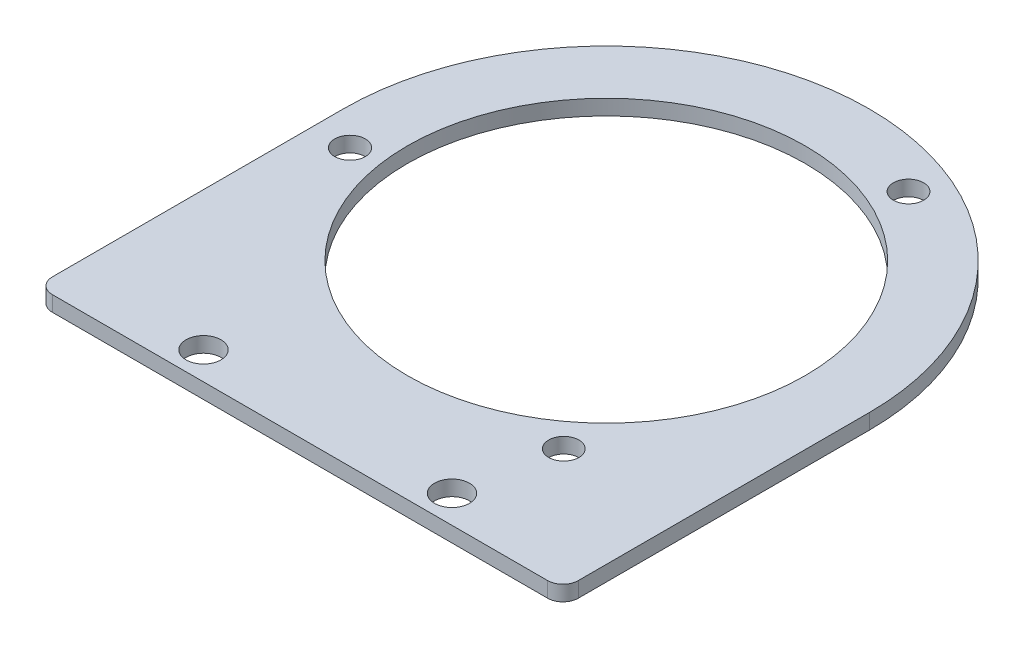
ISO-10303-21;
HEADER;
FILE_DESCRIPTION(('STEP AP214'),'2;1');
FILE_NAME('part.step','',(''),(''),'','','');
FILE_SCHEMA(('AUTOMOTIVE_DESIGN { 1 0 10303 214 1 1 1 1 }'));
ENDSEC;
DATA;
#1=APPLICATION_CONTEXT('core data for automotive mechanical design processes');
#2=APPLICATION_PROTOCOL_DEFINITION('international standard','automotive_design',2000,#1);
#3=PRODUCT_CONTEXT('',#1,'mechanical');
#4=PRODUCT('Part','Part','',(#3));
#5=PRODUCT_RELATED_PRODUCT_CATEGORY('part','',(#4));
#6=PRODUCT_DEFINITION_FORMATION('','',#4);
#7=PRODUCT_DEFINITION_CONTEXT('part definition',#1,'design');
#8=PRODUCT_DEFINITION('design','',#6,#7);
#9=PRODUCT_DEFINITION_SHAPE('','',#8);
#10=(LENGTH_UNIT() NAMED_UNIT(*) SI_UNIT(.MILLI.,.METRE.));
#11=(NAMED_UNIT(*) PLANE_ANGLE_UNIT() SI_UNIT($,.RADIAN.));
#12=(NAMED_UNIT(*) SI_UNIT($,.STERADIAN.) SOLID_ANGLE_UNIT());
#13=UNCERTAINTY_MEASURE_WITH_UNIT(LENGTH_MEASURE(1.E-05),#10,'distance_accuracy_value','');
#14=(GEOMETRIC_REPRESENTATION_CONTEXT(3) GLOBAL_UNCERTAINTY_ASSIGNED_CONTEXT((#13)) GLOBAL_UNIT_ASSIGNED_CONTEXT((#10,
#11,#12)) REPRESENTATION_CONTEXT('',''));
#15=CARTESIAN_POINT('',(0.,0.,0.));
#16=DIRECTION('',(0.,0.,1.));
#17=DIRECTION('',(1.,0.,0.));
#18=AXIS2_PLACEMENT_3D('',#15,#16,#17);
#19=CARTESIAN_POINT('',(-102.682677733851,6.35,120.65));
#20=DIRECTION('',(0.,-1.,0.));
#21=DIRECTION('',(0.,0.,-1.));
#22=AXIS2_PLACEMENT_3D('',#19,#20,#21);
#23=PLANE('',#22);
#24=CARTESIAN_POINT('',(51.5149387529781,6.35,115.487351308741));
#25=DIRECTION('',(0.,-1.,0.));
#26=DIRECTION('',(0.,0.,-1.));
#27=AXIS2_PLACEMENT_3D('',#24,#25,#26);
#28=CIRCLE('',#27,7.24664219784232);
#29=CARTESIAN_POINT('',(51.5149387529781,6.35,108.240709110899));
#30=VERTEX_POINT('',#29);
#31=EDGE_CURVE('E287',#30,#30,#28,.T.);
#32=ORIENTED_EDGE('',*,*,#31,.T.);
#33=EDGE_LOOP('',(#32));
#34=FACE_BOUND('',#33,.T.);
#35=CARTESIAN_POINT('',(-102.682677733851,6.35,120.65));
#36=DIRECTION('',(0.,-1.,0.));
#37=DIRECTION('',(0.,0.,-1.));
#38=AXIS2_PLACEMENT_3D('',#35,#36,#37);
#39=CIRCLE('',#38,6.34999999999998);
#40=CARTESIAN_POINT('',(-102.682677733851,6.35,127.));
#41=VERTEX_POINT('',#40);
#42=CARTESIAN_POINT('',(-109.032677733851,6.35,120.65));
#43=VERTEX_POINT('',#42);
#44=EDGE_CURVE('E269',#41,#43,#39,.T.);
#45=ORIENTED_EDGE('',*,*,#44,.F.);
#46=DIRECTION('',(1.,0.,0.));
#47=VECTOR('',#46,1.);
#48=CARTESIAN_POINT('',(-102.682677733851,6.35,127.));
#49=LINE('',#48,#47);
#50=CARTESIAN_POINT('',(102.682677733851,6.35,127.));
#51=VERTEX_POINT('',#50);
#52=EDGE_CURVE('E235',#41,#51,#49,.T.);
#53=ORIENTED_EDGE('',*,*,#52,.T.);
#54=CARTESIAN_POINT('',(102.682677733851,6.35,120.65));
#55=DIRECTION('',(0.,1.,0.));
#56=DIRECTION('',(0.,0.,1.));
#57=AXIS2_PLACEMENT_3D('',#54,#55,#56);
#58=CIRCLE('',#57,6.35000000000001);
#59=CARTESIAN_POINT('',(109.032677733851,6.35,120.65));
#60=VERTEX_POINT('',#59);
#61=EDGE_CURVE('E229',#51,#60,#58,.T.);
#62=ORIENTED_EDGE('',*,*,#61,.T.);
#63=DIRECTION('',(0.,0.,-1.));
#64=VECTOR('',#63,1.);
#65=CARTESIAN_POINT('',(109.032677733851,6.35,120.65));
#66=LINE('',#65,#64);
#67=CARTESIAN_POINT('',(109.032677733851,6.35,0.));
#68=VERTEX_POINT('',#67);
#69=EDGE_CURVE('E233',#60,#68,#66,.T.);
#70=ORIENTED_EDGE('',*,*,#69,.T.);
#71=CARTESIAN_POINT('',(0.,6.35,0.));
#72=DIRECTION('',(0.,-1.,0.));
#73=DIRECTION('',(0.,0.,-1.));
#74=AXIS2_PLACEMENT_3D('',#71,#72,#73);
#75=CIRCLE('',#74,109.032677733851);
#76=CARTESIAN_POINT('',(-109.032677733851,6.35,0.));
#77=VERTEX_POINT('',#76);
#78=EDGE_CURVE('E250',#77,#68,#75,.T.);
#79=ORIENTED_EDGE('',*,*,#78,.F.);
#80=DIRECTION('',(0.,0.,1.));
#81=VECTOR('',#80,1.);
#82=CARTESIAN_POINT('',(-109.032677733851,6.35,0.));
#83=LINE('',#82,#81);
#84=EDGE_CURVE('E220',#77,#43,#83,.T.);
#85=ORIENTED_EDGE('',*,*,#84,.T.);
#86=EDGE_LOOP('',(#45,#53,#62,#70,#79,#85));
#87=FACE_BOUND('',#86,.T.);
#88=CARTESIAN_POINT('',(0.,6.35,0.));
#89=DIRECTION('',(0.,1.,0.));
#90=DIRECTION('',(0.,0.,1.));
#91=AXIS2_PLACEMENT_3D('',#88,#89,#90);
#92=CIRCLE('',#91,82.4943104699617);
#93=CARTESIAN_POINT('',(0.,6.35,82.4943104699617));
#94=VERTEX_POINT('',#93);
#95=EDGE_CURVE('E260',#94,#94,#92,.T.);
#96=ORIENTED_EDGE('',*,*,#95,.F.);
#97=EDGE_LOOP('',(#96));
#98=FACE_BOUND('',#97,.T.);
#99=CARTESIAN_POINT('',(-51.5149387529781,6.35,115.487351308741));
#100=DIRECTION('',(0.,1.,0.));
#101=DIRECTION('',(0.,0.,1.));
#102=AXIS2_PLACEMENT_3D('',#99,#100,#101);
#103=CIRCLE('',#102,7.24664219784231);
#104=CARTESIAN_POINT('',(-51.5149387529781,6.35,122.733993506584));
#105=VERTEX_POINT('',#104);
#106=EDGE_CURVE('E293',#105,#105,#103,.T.);
#107=ORIENTED_EDGE('',*,*,#106,.F.);
#108=EDGE_LOOP('',(#107));
#109=FACE_BOUND('',#108,.T.);
#110=CARTESIAN_POINT('',(-93.6824363090608,6.35,12.5610675607337));
#111=DIRECTION('',(0.,1.,0.));
#112=DIRECTION('',(0.,0.,1.));
#113=AXIS2_PLACEMENT_3D('',#110,#111,#112);
#114=CIRCLE('',#113,6.35187519048072);
#115=CARTESIAN_POINT('',(-93.6824363090608,6.35,18.9129427512144));
#116=VERTEX_POINT('',#115);
#117=EDGE_CURVE('E299',#116,#116,#114,.T.);
#118=ORIENTED_EDGE('',*,*,#117,.F.);
#119=EDGE_LOOP('',(#118));
#120=FACE_BOUND('',#119,.T.);
#121=CARTESIAN_POINT('',(58.6973577692165,6.35,76.3198753039074));
#122=DIRECTION('',(0.,1.,0.));
#123=DIRECTION('',(0.,0.,1.));
#124=AXIS2_PLACEMENT_3D('',#121,#122,#123);
#125=CIRCLE('',#124,6.27839869121901);
#126=CARTESIAN_POINT('',(58.6973577692165,6.35,82.5982739951264));
#127=VERTEX_POINT('',#126);
#128=EDGE_CURVE('E305',#127,#127,#125,.T.);
#129=ORIENTED_EDGE('',*,*,#128,.F.);
#130=EDGE_LOOP('',(#129));
#131=FACE_BOUND('',#130,.T.);
#132=CARTESIAN_POINT('',(37.8028439954295,6.35,-87.5004935949573));
#133=DIRECTION('',(0.,1.,0.));
#134=DIRECTION('',(0.,0.,1.));
#135=AXIS2_PLACEMENT_3D('',#132,#133,#134);
#136=CIRCLE('',#135,6.28350227414745);
#137=CARTESIAN_POINT('',(37.8028439954295,6.35,-81.2169913208098));
#138=VERTEX_POINT('',#137);
#139=EDGE_CURVE('E311',#138,#138,#136,.T.);
#140=ORIENTED_EDGE('',*,*,#139,.F.);
#141=EDGE_LOOP('',(#140));
#142=FACE_BOUND('',#141,.T.);
#143=ADVANCED_FACE('F170',(#34,#87,#98,#109,#120,#131,#142),#23,.F.);
#144=CARTESIAN_POINT('',(-102.682677733851,0.,120.65));
#145=DIRECTION('',(0.,-1.,0.));
#146=DIRECTION('',(0.,0.,-1.));
#147=AXIS2_PLACEMENT_3D('',#144,#145,#146);
#148=PLANE('',#147);
#149=CARTESIAN_POINT('',(58.6973577692165,0.,76.3198753039074));
#150=DIRECTION('',(0.,1.,0.));
#151=DIRECTION('',(0.,0.,1.));
#152=AXIS2_PLACEMENT_3D('',#149,#150,#151);
#153=CIRCLE('',#152,6.27839869121901);
#154=CARTESIAN_POINT('',(58.6973577692165,0.,82.5982739951264));
#155=VERTEX_POINT('',#154);
#156=EDGE_CURVE('E308',#155,#155,#153,.T.);
#157=ORIENTED_EDGE('',*,*,#156,.T.);
#158=EDGE_LOOP('',(#157));
#159=FACE_BOUND('',#158,.T.);
#160=CARTESIAN_POINT('',(-51.5149387529781,0.,115.487351308741));
#161=DIRECTION('',(0.,1.,0.));
#162=DIRECTION('',(0.,0.,1.));
#163=AXIS2_PLACEMENT_3D('',#160,#161,#162);
#164=CIRCLE('',#163,7.24664219784231);
#165=CARTESIAN_POINT('',(-51.5149387529781,0.,122.733993506584));
#166=VERTEX_POINT('',#165);
#167=EDGE_CURVE('E296',#166,#166,#164,.T.);
#168=ORIENTED_EDGE('',*,*,#167,.T.);
#169=EDGE_LOOP('',(#168));
#170=FACE_BOUND('',#169,.T.);
#171=CARTESIAN_POINT('',(51.5149387529781,0.,115.487351308741));
#172=DIRECTION('',(0.,-1.,0.));
#173=DIRECTION('',(0.,0.,-1.));
#174=AXIS2_PLACEMENT_3D('',#171,#172,#173);
#175=CIRCLE('',#174,7.24664219784232);
#176=CARTESIAN_POINT('',(51.5149387529781,0.,108.240709110899));
#177=VERTEX_POINT('',#176);
#178=EDGE_CURVE('E290',#177,#177,#175,.T.);
#179=ORIENTED_EDGE('',*,*,#178,.F.);
#180=EDGE_LOOP('',(#179));
#181=FACE_BOUND('',#180,.T.);
#182=CARTESIAN_POINT('',(-102.682677733851,0.,120.65));
#183=DIRECTION('',(0.,-1.,0.));
#184=DIRECTION('',(0.,0.,-1.));
#185=AXIS2_PLACEMENT_3D('',#182,#183,#184);
#186=CIRCLE('',#185,6.34999999999998);
#187=CARTESIAN_POINT('',(-102.682677733851,0.,127.));
#188=VERTEX_POINT('',#187);
#189=CARTESIAN_POINT('',(-109.032677733851,0.,120.65));
#190=VERTEX_POINT('',#189);
#191=EDGE_CURVE('E256',#188,#190,#186,.T.);
#192=ORIENTED_EDGE('',*,*,#191,.T.);
#193=DIRECTION('',(0.,0.,1.));
#194=VECTOR('',#193,1.);
#195=CARTESIAN_POINT('',(-109.032677733851,0.,0.));
#196=LINE('',#195,#194);
#197=CARTESIAN_POINT('',(-109.032677733851,0.,0.));
#198=VERTEX_POINT('',#197);
#199=EDGE_CURVE('E259',#198,#190,#196,.T.);
#200=ORIENTED_EDGE('',*,*,#199,.F.);
#201=CARTESIAN_POINT('',(0.,0.,0.));
#202=DIRECTION('',(0.,-1.,0.));
#203=DIRECTION('',(0.,0.,-1.));
#204=AXIS2_PLACEMENT_3D('',#201,#202,#203);
#205=CIRCLE('',#204,109.032677733851);
#206=CARTESIAN_POINT('',(109.032677733851,0.,0.));
#207=VERTEX_POINT('',#206);
#208=EDGE_CURVE('E263',#198,#207,#205,.T.);
#209=ORIENTED_EDGE('',*,*,#208,.T.);
#210=DIRECTION('',(0.,0.,-1.));
#211=VECTOR('',#210,1.);
#212=CARTESIAN_POINT('',(109.032677733851,0.,120.65));
#213=LINE('',#212,#211);
#214=CARTESIAN_POINT('',(109.032677733851,0.,120.65));
#215=VERTEX_POINT('',#214);
#216=EDGE_CURVE('E266',#215,#207,#213,.T.);
#217=ORIENTED_EDGE('',*,*,#216,.F.);
#218=CARTESIAN_POINT('',(102.682677733851,0.,120.65));
#219=DIRECTION('',(0.,1.,0.));
#220=DIRECTION('',(0.,0.,1.));
#221=AXIS2_PLACEMENT_3D('',#218,#219,#220);
#222=CIRCLE('',#221,6.35000000000001);
#223=CARTESIAN_POINT('',(102.682677733851,0.,127.));
#224=VERTEX_POINT('',#223);
#225=EDGE_CURVE('E242',#224,#215,#222,.T.);
#226=ORIENTED_EDGE('',*,*,#225,.F.);
#227=DIRECTION('',(1.,0.,0.));
#228=VECTOR('',#227,1.);
#229=CARTESIAN_POINT('',(-102.682677733851,0.,127.));
#230=LINE('',#229,#228);
#231=EDGE_CURVE('E210',#188,#224,#230,.T.);
#232=ORIENTED_EDGE('',*,*,#231,.F.);
#233=EDGE_LOOP('',(#192,#200,#209,#217,#226,#232));
#234=FACE_BOUND('',#233,.T.);
#235=CARTESIAN_POINT('',(0.,0.,0.));
#236=DIRECTION('',(0.,1.,0.));
#237=DIRECTION('',(0.,0.,1.));
#238=AXIS2_PLACEMENT_3D('',#235,#236,#237);
#239=CIRCLE('',#238,82.4943104699617);
#240=CARTESIAN_POINT('',(0.,0.,82.4943104699617));
#241=VERTEX_POINT('',#240);
#242=EDGE_CURVE('E284',#241,#241,#239,.T.);
#243=ORIENTED_EDGE('',*,*,#242,.T.);
#244=EDGE_LOOP('',(#243));
#245=FACE_BOUND('',#244,.T.);
#246=CARTESIAN_POINT('',(-93.6824363090608,0.,12.5610675607337));
#247=DIRECTION('',(0.,1.,0.));
#248=DIRECTION('',(0.,0.,1.));
#249=AXIS2_PLACEMENT_3D('',#246,#247,#248);
#250=CIRCLE('',#249,6.35187519048072);
#251=CARTESIAN_POINT('',(-93.6824363090608,0.,18.9129427512144));
#252=VERTEX_POINT('',#251);
#253=EDGE_CURVE('E302',#252,#252,#250,.T.);
#254=ORIENTED_EDGE('',*,*,#253,.T.);
#255=EDGE_LOOP('',(#254));
#256=FACE_BOUND('',#255,.T.);
#257=CARTESIAN_POINT('',(37.8028439954295,0.,-87.5004935949573));
#258=DIRECTION('',(0.,1.,0.));
#259=DIRECTION('',(0.,0.,1.));
#260=AXIS2_PLACEMENT_3D('',#257,#258,#259);
#261=CIRCLE('',#260,6.28350227414745);
#262=CARTESIAN_POINT('',(37.8028439954295,0.,-81.2169913208098));
#263=VERTEX_POINT('',#262);
#264=EDGE_CURVE('E314',#263,#263,#261,.T.);
#265=ORIENTED_EDGE('',*,*,#264,.T.);
#266=EDGE_LOOP('',(#265));
#267=FACE_BOUND('',#266,.T.);
#268=ADVANCED_FACE('F278',(#159,#170,#181,#234,#245,#256,#267),#148,.T.);
#269=CARTESIAN_POINT('',(-102.682677733851,6.35,120.65));
#270=DIRECTION('',(0.,-1.,0.));
#271=DIRECTION('',(0.,0.,-1.));
#272=AXIS2_PLACEMENT_3D('',#269,#270,#271);
#273=CYLINDRICAL_SURFACE('',#272,6.34999999999998);
#274=ORIENTED_EDGE('',*,*,#191,.F.);
#275=DIRECTION('',(0.,-1.,0.));
#276=VECTOR('',#275,1.);
#277=CARTESIAN_POINT('',(-102.682677733851,6.35,127.));
#278=LINE('',#277,#276);
#279=EDGE_CURVE('E12',#41,#188,#278,.T.);
#280=ORIENTED_EDGE('',*,*,#279,.F.);
#281=ORIENTED_EDGE('',*,*,#44,.T.);
#282=DIRECTION('',(0.,-1.,0.));
#283=VECTOR('',#282,1.);
#284=CARTESIAN_POINT('',(-109.032677733851,6.35,120.65));
#285=LINE('',#284,#283);
#286=EDGE_CURVE('E174',#43,#190,#285,.T.);
#287=ORIENTED_EDGE('',*,*,#286,.T.);
#288=EDGE_LOOP('',(#274,#280,#281,#287));
#289=FACE_BOUND('',#288,.T.);
#290=ADVANCED_FACE('F172',(#289),#273,.T.);
#291=CARTESIAN_POINT('',(-102.682677733851,6.35,127.));
#292=DIRECTION('',(0.,0.,-1.));
#293=DIRECTION('',(-1.,0.,0.));
#294=AXIS2_PLACEMENT_3D('',#291,#292,#293);
#295=PLANE('',#294);
#296=ORIENTED_EDGE('',*,*,#231,.T.);
#297=DIRECTION('',(0.,-1.,0.));
#298=VECTOR('',#297,1.);
#299=CARTESIAN_POINT('',(102.682677733851,6.35,127.));
#300=LINE('',#299,#298);
#301=EDGE_CURVE('E180',#51,#224,#300,.T.);
#302=ORIENTED_EDGE('',*,*,#301,.F.);
#303=ORIENTED_EDGE('',*,*,#52,.F.);
#304=ORIENTED_EDGE('',*,*,#279,.T.);
#305=EDGE_LOOP('',(#296,#302,#303,#304));
#306=FACE_BOUND('',#305,.T.);
#307=ADVANCED_FACE('F335',(#306),#295,.F.);
#308=CARTESIAN_POINT('',(102.682677733851,6.35,120.65));
#309=DIRECTION('',(0.,-1.,0.));
#310=DIRECTION('',(0.,0.,-1.));
#311=AXIS2_PLACEMENT_3D('',#308,#309,#310);
#312=CYLINDRICAL_SURFACE('',#311,6.35000000000001);
#313=ORIENTED_EDGE('',*,*,#225,.T.);
#314=DIRECTION('',(0.,-1.,0.));
#315=VECTOR('',#314,1.);
#316=CARTESIAN_POINT('',(109.032677733851,6.35,120.65));
#317=LINE('',#316,#315);
#318=EDGE_CURVE('E239',#60,#215,#317,.T.);
#319=ORIENTED_EDGE('',*,*,#318,.F.);
#320=ORIENTED_EDGE('',*,*,#61,.F.);
#321=ORIENTED_EDGE('',*,*,#301,.T.);
#322=EDGE_LOOP('',(#313,#319,#320,#321));
#323=FACE_BOUND('',#322,.T.);
#324=ADVANCED_FACE('F240',(#323),#312,.T.);
#325=CARTESIAN_POINT('',(109.032677733851,6.35,120.65));
#326=DIRECTION('',(-1.,0.,0.));
#327=DIRECTION('',(0.,0.,1.));
#328=AXIS2_PLACEMENT_3D('',#325,#326,#327);
#329=PLANE('',#328);
#330=ORIENTED_EDGE('',*,*,#216,.T.);
#331=DIRECTION('',(0.,-1.,0.));
#332=VECTOR('',#331,1.);
#333=CARTESIAN_POINT('',(109.032677733851,6.35,0.));
#334=LINE('',#333,#332);
#335=EDGE_CURVE('E246',#68,#207,#334,.T.);
#336=ORIENTED_EDGE('',*,*,#335,.F.);
#337=ORIENTED_EDGE('',*,*,#69,.F.);
#338=ORIENTED_EDGE('',*,*,#318,.T.);
#339=EDGE_LOOP('',(#330,#336,#337,#338));
#340=FACE_BOUND('',#339,.T.);
#341=ADVANCED_FACE('F248',(#340),#329,.F.);
#342=CARTESIAN_POINT('',(0.,6.35,0.));
#343=DIRECTION('',(0.,-1.,0.));
#344=DIRECTION('',(0.,0.,-1.));
#345=AXIS2_PLACEMENT_3D('',#342,#343,#344);
#346=CYLINDRICAL_SURFACE('',#345,109.032677733851);
#347=ORIENTED_EDGE('',*,*,#208,.F.);
#348=DIRECTION('',(0.,-1.,0.));
#349=VECTOR('',#348,1.);
#350=CARTESIAN_POINT('',(-109.032677733851,6.35,0.));
#351=LINE('',#350,#349);
#352=EDGE_CURVE('E272',#77,#198,#351,.T.);
#353=ORIENTED_EDGE('',*,*,#352,.F.);
#354=ORIENTED_EDGE('',*,*,#78,.T.);
#355=ORIENTED_EDGE('',*,*,#335,.T.);
#356=EDGE_LOOP('',(#347,#353,#354,#355));
#357=FACE_BOUND('',#356,.T.);
#358=ADVANCED_FACE('F281',(#357),#346,.T.);
#359=CARTESIAN_POINT('',(-109.032677733851,6.35,0.));
#360=DIRECTION('',(1.,0.,0.));
#361=DIRECTION('',(0.,0.,-1.));
#362=AXIS2_PLACEMENT_3D('',#359,#360,#361);
#363=PLANE('',#362);
#364=ORIENTED_EDGE('',*,*,#199,.T.);
#365=ORIENTED_EDGE('',*,*,#286,.F.);
#366=ORIENTED_EDGE('',*,*,#84,.F.);
#367=ORIENTED_EDGE('',*,*,#352,.T.);
#368=EDGE_LOOP('',(#364,#365,#366,#367));
#369=FACE_BOUND('',#368,.T.);
#370=ADVANCED_FACE('F275',(#369),#363,.F.);
#371=CARTESIAN_POINT('',(0.,6.35,0.));
#372=DIRECTION('',(0.,-1.,0.));
#373=DIRECTION('',(0.,0.,-1.));
#374=AXIS2_PLACEMENT_3D('',#371,#372,#373);
#375=CYLINDRICAL_SURFACE('',#374,82.4943104699617);
#376=ORIENTED_EDGE('',*,*,#95,.T.);
#377=EDGE_LOOP('',(#376));
#378=FACE_BOUND('',#377,.T.);
#379=ORIENTED_EDGE('',*,*,#242,.F.);
#380=EDGE_LOOP('',(#379));
#381=FACE_BOUND('',#380,.T.);
#382=ADVANCED_FACE('F332',(#378,#381),#375,.F.);
#383=CARTESIAN_POINT('',(51.5149387529781,6.35,115.487351308741));
#384=DIRECTION('',(0.,-1.,0.));
#385=DIRECTION('',(0.,0.,-1.));
#386=AXIS2_PLACEMENT_3D('',#383,#384,#385);
#387=CYLINDRICAL_SURFACE('',#386,7.24664219784232);
#388=ORIENTED_EDGE('',*,*,#31,.F.);
#389=EDGE_LOOP('',(#388));
#390=FACE_BOUND('',#389,.T.);
#391=ORIENTED_EDGE('',*,*,#178,.T.);
#392=EDGE_LOOP('',(#391));
#393=FACE_BOUND('',#392,.T.);
#394=ADVANCED_FACE('F347',(#390,#393),#387,.F.);
#395=CARTESIAN_POINT('',(-51.5149387529781,6.35,115.487351308741));
#396=DIRECTION('',(0.,-1.,0.));
#397=DIRECTION('',(0.,0.,-1.));
#398=AXIS2_PLACEMENT_3D('',#395,#396,#397);
#399=CYLINDRICAL_SURFACE('',#398,7.24664219784231);
#400=ORIENTED_EDGE('',*,*,#106,.T.);
#401=EDGE_LOOP('',(#400));
#402=FACE_BOUND('',#401,.T.);
#403=ORIENTED_EDGE('',*,*,#167,.F.);
#404=EDGE_LOOP('',(#403));
#405=FACE_BOUND('',#404,.T.);
#406=ADVANCED_FACE('F352',(#402,#405),#399,.F.);
#407=CARTESIAN_POINT('',(-93.6824363090608,6.35,12.5610675607337));
#408=DIRECTION('',(0.,-1.,0.));
#409=DIRECTION('',(0.,0.,-1.));
#410=AXIS2_PLACEMENT_3D('',#407,#408,#409);
#411=CYLINDRICAL_SURFACE('',#410,6.35187519048072);
#412=ORIENTED_EDGE('',*,*,#117,.T.);
#413=EDGE_LOOP('',(#412));
#414=FACE_BOUND('',#413,.T.);
#415=ORIENTED_EDGE('',*,*,#253,.F.);
#416=EDGE_LOOP('',(#415));
#417=FACE_BOUND('',#416,.T.);
#418=ADVANCED_FACE('F367',(#414,#417),#411,.F.);
#419=CARTESIAN_POINT('',(58.6973577692165,6.35,76.3198753039074));
#420=DIRECTION('',(0.,-1.,0.));
#421=DIRECTION('',(0.,0.,-1.));
#422=AXIS2_PLACEMENT_3D('',#419,#420,#421);
#423=CYLINDRICAL_SURFACE('',#422,6.27839869121901);
#424=ORIENTED_EDGE('',*,*,#128,.T.);
#425=EDGE_LOOP('',(#424));
#426=FACE_BOUND('',#425,.T.);
#427=ORIENTED_EDGE('',*,*,#156,.F.);
#428=EDGE_LOOP('',(#427));
#429=FACE_BOUND('',#428,.T.);
#430=ADVANCED_FACE('F362',(#426,#429),#423,.F.);
#431=CARTESIAN_POINT('',(37.8028439954295,6.35,-87.5004935949573));
#432=DIRECTION('',(0.,-1.,0.));
#433=DIRECTION('',(0.,0.,-1.));
#434=AXIS2_PLACEMENT_3D('',#431,#432,#433);
#435=CYLINDRICAL_SURFACE('',#434,6.28350227414745);
#436=ORIENTED_EDGE('',*,*,#139,.T.);
#437=EDGE_LOOP('',(#436));
#438=FACE_BOUND('',#437,.T.);
#439=ORIENTED_EDGE('',*,*,#264,.F.);
#440=EDGE_LOOP('',(#439));
#441=FACE_BOUND('',#440,.T.);
#442=ADVANCED_FACE('F320',(#438,#441),#435,.F.);
#443=CLOSED_SHELL('',(#143,#268,#290,#307,#324,#341,#358,#370,#382,#394,#406,#418,#430,#442));
#444=MANIFOLD_SOLID_BREP('B2',#443);
#445=ADVANCED_BREP_SHAPE_REPRESENTATION('',(#18,#444),#14);
#446=SHAPE_DEFINITION_REPRESENTATION(#9,#445);
ENDSEC;
END-ISO-10303-21;
